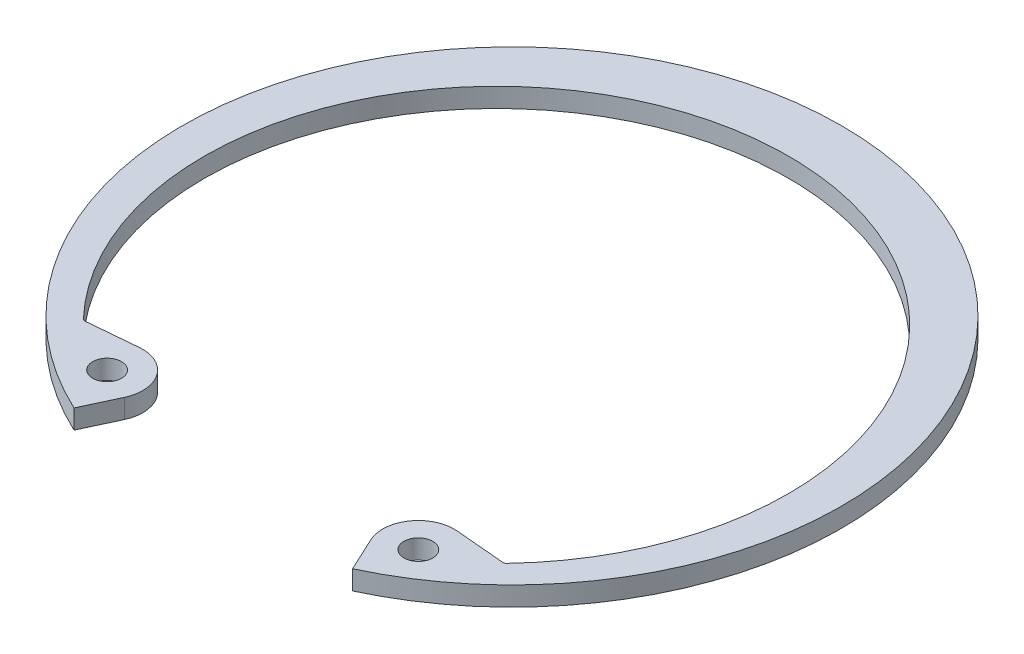
ISO-10303-21;
HEADER;
FILE_DESCRIPTION(('STEP AP214'),'2;1');
FILE_NAME('part.step','',(''),(''),'','','');
FILE_SCHEMA(('AUTOMOTIVE_DESIGN { 1 0 10303 214 1 1 1 1 }'));
ENDSEC;
DATA;
#1=APPLICATION_CONTEXT('core data for automotive mechanical design processes');
#2=APPLICATION_PROTOCOL_DEFINITION('international standard','automotive_design',2000,#1);
#3=PRODUCT_CONTEXT('',#1,'mechanical');
#4=PRODUCT('Part','Part','',(#3));
#5=PRODUCT_RELATED_PRODUCT_CATEGORY('part','',(#4));
#6=PRODUCT_DEFINITION_FORMATION('','',#4);
#7=PRODUCT_DEFINITION_CONTEXT('part definition',#1,'design');
#8=PRODUCT_DEFINITION('design','',#6,#7);
#9=PRODUCT_DEFINITION_SHAPE('','',#8);
#10=(LENGTH_UNIT() NAMED_UNIT(*) SI_UNIT(.MILLI.,.METRE.));
#11=(NAMED_UNIT(*) PLANE_ANGLE_UNIT() SI_UNIT($,.RADIAN.));
#12=(NAMED_UNIT(*) SI_UNIT($,.STERADIAN.) SOLID_ANGLE_UNIT());
#13=UNCERTAINTY_MEASURE_WITH_UNIT(LENGTH_MEASURE(1.E-05),#10,'distance_accuracy_value','');
#14=(GEOMETRIC_REPRESENTATION_CONTEXT(3) GLOBAL_UNCERTAINTY_ASSIGNED_CONTEXT((#13)) GLOBAL_UNIT_ASSIGNED_CONTEXT((#10,
#11,#12)) REPRESENTATION_CONTEXT('',''));
#15=CARTESIAN_POINT('',(0.,0.,0.));
#16=DIRECTION('',(0.,0.,1.));
#17=DIRECTION('',(1.,0.,0.));
#18=AXIS2_PLACEMENT_3D('',#15,#16,#17);
#19=CARTESIAN_POINT('',(12.7268526802508,-1.5748,20.3811488247153));
#20=DIRECTION('',(0.,1.,0.));
#21=DIRECTION('',(0.,0.,1.));
#22=AXIS2_PLACEMENT_3D('',#19,#20,#21);
#23=CYLINDRICAL_SURFACE('',#22,2.921);
#24=CARTESIAN_POINT('',(12.7268526802508,0.,20.3811488247153));
#25=DIRECTION('',(0.,1.,0.));
#26=DIRECTION('',(0.,0.,-1.));
#27=AXIS2_PLACEMENT_3D('',#24,#25,#26);
#28=CIRCLE('',#27,2.921);
#29=CARTESIAN_POINT('',(12.9814346048167,0.,17.4712641115893));
#30=VERTEX_POINT('',#29);
#31=CARTESIAN_POINT('',(10.0795276343167,0.,21.6156167672599));
#32=VERTEX_POINT('',#31);
#33=EDGE_CURVE('E156',#30,#32,#28,.T.);
#34=ORIENTED_EDGE('',*,*,#33,.F.);
#35=DIRECTION('',(0.,1.,0.));
#36=VECTOR('',#35,1.);
#37=CARTESIAN_POINT('',(12.9814346048167,-1.5748,17.4712641115893));
#38=LINE('',#37,#36);
#39=CARTESIAN_POINT('',(12.9814346048167,-1.5748,17.4712641115893));
#40=VERTEX_POINT('',#39);
#41=EDGE_CURVE('E133',#40,#30,#38,.T.);
#42=ORIENTED_EDGE('',*,*,#41,.F.);
#43=CARTESIAN_POINT('',(12.7268526802508,-1.5748,20.3811488247153));
#44=DIRECTION('',(0.,1.,0.));
#45=DIRECTION('',(0.,0.,-1.));
#46=AXIS2_PLACEMENT_3D('',#43,#44,#45);
#47=CIRCLE('',#46,2.921);
#48=CARTESIAN_POINT('',(10.0795276343167,-1.5748,21.6156167672599));
#49=VERTEX_POINT('',#48);
#50=EDGE_CURVE('E126',#40,#49,#47,.T.);
#51=ORIENTED_EDGE('',*,*,#50,.T.);
#52=DIRECTION('',(0.,1.,0.));
#53=VECTOR('',#52,1.);
#54=CARTESIAN_POINT('',(10.0795276343167,-1.5748,21.6156167672599));
#55=LINE('',#54,#53);
#56=EDGE_CURVE('E109',#49,#32,#55,.T.);
#57=ORIENTED_EDGE('',*,*,#56,.T.);
#58=EDGE_LOOP('',(#34,#42,#51,#57));
#59=FACE_BOUND('',#58,.T.);
#60=ADVANCED_FACE('F34',(#59),#23,.T.);
#61=CARTESIAN_POINT('',(17.2118873044227,-1.5748,17.8413807643875));
#62=DIRECTION('',(0.0871557427476606,0.,-0.996194698091745));
#63=DIRECTION('',(-0.996194698091745,0.,-0.0871557427476606));
#64=AXIS2_PLACEMENT_3D('',#61,#62,#63);
#65=PLANE('',#64);
#66=DIRECTION('',(-0.996194698091745,0.,-0.0871557427476606));
#67=VECTOR('',#66,1.);
#68=CARTESIAN_POINT('',(17.2118873044227,0.,17.8413807643875));
#69=LINE('',#68,#67);
#70=CARTESIAN_POINT('',(17.0905898602113,0.,17.8307686131043));
#71=VERTEX_POINT('',#70);
#72=EDGE_CURVE('E134',#71,#30,#69,.T.);
#73=ORIENTED_EDGE('',*,*,#72,.F.);
#74=DIRECTION('',(0.,-1.,0.));
#75=VECTOR('',#74,1.);
#76=CARTESIAN_POINT('',(17.0905898602113,-1.5748,17.8307686131043));
#77=LINE('',#76,#75);
#78=CARTESIAN_POINT('',(17.0905898602113,-1.5748,17.8307686131043));
#79=VERTEX_POINT('',#78);
#80=EDGE_CURVE('E49',#71,#79,#77,.T.);
#81=ORIENTED_EDGE('',*,*,#80,.T.);
#82=DIRECTION('',(-0.996194698091745,0.,-0.0871557427476606));
#83=VECTOR('',#82,1.);
#84=CARTESIAN_POINT('',(17.2118873044227,-1.5748,17.8413807643875));
#85=LINE('',#84,#83);
#86=EDGE_CURVE('E120',#79,#40,#85,.T.);
#87=ORIENTED_EDGE('',*,*,#86,.T.);
#88=ORIENTED_EDGE('',*,*,#41,.T.);
#89=EDGE_LOOP('',(#73,#81,#87,#88));
#90=FACE_BOUND('',#89,.T.);
#91=ADVANCED_FACE('F211',(#90),#65,.T.);
#92=CARTESIAN_POINT('',(0.,-1.5748,1.26484595654581));
#93=DIRECTION('',(0.,1.,0.));
#94=DIRECTION('',(0.,0.,1.));
#95=AXIS2_PLACEMENT_3D('',#92,#93,#94);
#96=CYLINDRICAL_SURFACE('',#95,23.8962459565458);
#97=CARTESIAN_POINT('',(0.,0.,1.26484595654581));
#98=DIRECTION('',(0.,-1.,0.));
#99=DIRECTION('',(0.,0.,1.));
#100=AXIS2_PLACEMENT_3D('',#97,#98,#99);
#101=CIRCLE('',#100,23.8962459565458);
#102=CARTESIAN_POINT('',(-17.296577666108,0.,17.7529923610396));
#103=VERTEX_POINT('',#102);
#104=CARTESIAN_POINT('',(17.2965776661081,0.,17.7529923610397));
#105=VERTEX_POINT('',#104);
#106=EDGE_CURVE('E136',#103,#105,#101,.T.);
#107=ORIENTED_EDGE('',*,*,#106,.F.);
#108=DIRECTION('',(0.,1.,0.));
#109=VECTOR('',#108,1.);
#110=CARTESIAN_POINT('',(-17.2965776661081,-1.5748,17.7529923610396));
#111=LINE('',#110,#109);
#112=CARTESIAN_POINT('',(-17.296577666108,-1.5748,17.7529923610396));
#113=VERTEX_POINT('',#112);
#114=EDGE_CURVE('E187',#103,#113,#111,.F.);
#115=ORIENTED_EDGE('',*,*,#114,.T.);
#116=CARTESIAN_POINT('',(0.,-1.5748,1.26484595654581));
#117=DIRECTION('',(0.,-1.,0.));
#118=DIRECTION('',(0.,0.,1.));
#119=AXIS2_PLACEMENT_3D('',#116,#117,#118);
#120=CIRCLE('',#119,23.8962459565458);
#121=CARTESIAN_POINT('',(17.2965776661081,-1.5748,17.7529923610397));
#122=VERTEX_POINT('',#121);
#123=EDGE_CURVE('E152',#113,#122,#120,.T.);
#124=ORIENTED_EDGE('',*,*,#123,.T.);
#125=DIRECTION('',(0.,1.,0.));
#126=VECTOR('',#125,1.);
#127=CARTESIAN_POINT('',(17.2965776661081,-1.5748,17.7529923610397));
#128=LINE('',#127,#126);
#129=EDGE_CURVE('E184',#122,#105,#128,.T.);
#130=ORIENTED_EDGE('',*,*,#129,.T.);
#131=EDGE_LOOP('',(#107,#115,#124,#130));
#132=FACE_BOUND('',#131,.T.);
#133=ADVANCED_FACE('F207',(#132),#96,.F.);
#134=CARTESIAN_POINT('',(-17.2118873044226,-1.5748,17.8413807643875));
#135=DIRECTION('',(-0.0871557427476557,0.,-0.996194698091746));
#136=DIRECTION('',(-0.996194698091746,0.,0.0871557427476557));
#137=AXIS2_PLACEMENT_3D('',#134,#135,#136);
#138=PLANE('',#137);
#139=DIRECTION('',(-0.996194698091746,0.,0.0871557427476557));
#140=VECTOR('',#139,1.);
#141=CARTESIAN_POINT('',(-17.2118873044226,-1.5748,17.8413807643875));
#142=LINE('',#141,#140);
#143=CARTESIAN_POINT('',(-12.9814346048167,-1.5748,17.4712641115893));
#144=VERTEX_POINT('',#143);
#145=CARTESIAN_POINT('',(-17.0905898602113,-1.5748,17.8307686131043));
#146=VERTEX_POINT('',#145);
#147=EDGE_CURVE('E149',#144,#146,#142,.T.);
#148=ORIENTED_EDGE('',*,*,#147,.T.);
#149=DIRECTION('',(0.,-1.,0.));
#150=VECTOR('',#149,1.);
#151=CARTESIAN_POINT('',(-17.0905898602113,0.,17.8307686131043));
#152=LINE('',#151,#150);
#153=CARTESIAN_POINT('',(-17.0905898602113,0.,17.8307686131043));
#154=VERTEX_POINT('',#153);
#155=EDGE_CURVE('E174',#146,#154,#152,.F.);
#156=ORIENTED_EDGE('',*,*,#155,.T.);
#157=DIRECTION('',(-0.996194698091746,0.,0.0871557427476557));
#158=VECTOR('',#157,1.);
#159=CARTESIAN_POINT('',(-17.2118873044226,0.,17.8413807643875));
#160=LINE('',#159,#158);
#161=CARTESIAN_POINT('',(-12.9814346048167,0.,17.4712641115893));
#162=VERTEX_POINT('',#161);
#163=EDGE_CURVE('E169',#162,#154,#160,.T.);
#164=ORIENTED_EDGE('',*,*,#163,.F.);
#165=DIRECTION('',(0.,1.,0.));
#166=VECTOR('',#165,1.);
#167=CARTESIAN_POINT('',(-12.9814346048167,-1.5748,17.4712641115893));
#168=LINE('',#167,#166);
#169=EDGE_CURVE('E175',#144,#162,#168,.T.);
#170=ORIENTED_EDGE('',*,*,#169,.F.);
#171=EDGE_LOOP('',(#148,#156,#164,#170));
#172=FACE_BOUND('',#171,.T.);
#173=ADVANCED_FACE('F201',(#172),#138,.T.);
#174=CARTESIAN_POINT('',(-12.7268526802508,-1.5748,20.3811488247153));
#175=DIRECTION('',(0.,1.,0.));
#176=DIRECTION('',(0.,0.,1.));
#177=AXIS2_PLACEMENT_3D('',#174,#175,#176);
#178=CYLINDRICAL_SURFACE('',#177,2.921);
#179=CARTESIAN_POINT('',(-12.7268526802508,0.,20.3811488247153));
#180=DIRECTION('',(0.,1.,0.));
#181=DIRECTION('',(0.,0.,1.));
#182=AXIS2_PLACEMENT_3D('',#179,#180,#181);
#183=CIRCLE('',#182,2.921);
#184=CARTESIAN_POINT('',(-10.0795276343167,0.,21.6156167672599));
#185=VERTEX_POINT('',#184);
#186=EDGE_CURVE('E166',#185,#162,#183,.T.);
#187=ORIENTED_EDGE('',*,*,#186,.F.);
#188=DIRECTION('',(0.,1.,0.));
#189=VECTOR('',#188,1.);
#190=CARTESIAN_POINT('',(-10.0795276343167,-1.5748,21.6156167672599));
#191=LINE('',#190,#189);
#192=CARTESIAN_POINT('',(-10.0795276343167,-1.5748,21.6156167672599));
#193=VERTEX_POINT('',#192);
#194=EDGE_CURVE('E177',#193,#185,#191,.T.);
#195=ORIENTED_EDGE('',*,*,#194,.F.);
#196=CARTESIAN_POINT('',(-12.7268526802508,-1.5748,20.3811488247153));
#197=DIRECTION('',(0.,1.,0.));
#198=DIRECTION('',(0.,0.,1.));
#199=AXIS2_PLACEMENT_3D('',#196,#197,#198);
#200=CIRCLE('',#199,2.921);
#201=EDGE_CURVE('E146',#193,#144,#200,.T.);
#202=ORIENTED_EDGE('',*,*,#201,.T.);
#203=ORIENTED_EDGE('',*,*,#169,.T.);
#204=EDGE_LOOP('',(#187,#195,#202,#203));
#205=FACE_BOUND('',#204,.T.);
#206=ADVANCED_FACE('F220',(#205),#178,.T.);
#207=CARTESIAN_POINT('',(-11.3893085829547,-1.5748,24.4244510759656));
#208=DIRECTION('',(0.906307787036652,0.,0.422618261740694));
#209=DIRECTION('',(0.422618261740694,0.,-0.906307787036653));
#210=AXIS2_PLACEMENT_3D('',#207,#208,#209);
#211=PLANE('',#210);
#212=DIRECTION('',(0.422618261740694,0.,-0.906307787036652));
#213=VECTOR('',#212,1.);
#214=CARTESIAN_POINT('',(-11.3893085829547,0.,24.4244510759656));
#215=LINE('',#214,#213);
#216=CARTESIAN_POINT('',(-11.3893085829547,0.,24.4244510759656));
#217=VERTEX_POINT('',#216);
#218=EDGE_CURVE('E163',#217,#185,#215,.T.);
#219=ORIENTED_EDGE('',*,*,#218,.F.);
#220=DIRECTION('',(0.,1.,0.));
#221=VECTOR('',#220,1.);
#222=CARTESIAN_POINT('',(-11.3893085829547,-1.5748,24.4244510759656));
#223=LINE('',#222,#221);
#224=CARTESIAN_POINT('',(-11.3893085829547,-1.5748,24.4244510759656));
#225=VERTEX_POINT('',#224);
#226=EDGE_CURVE('E179',#225,#217,#223,.T.);
#227=ORIENTED_EDGE('',*,*,#226,.F.);
#228=DIRECTION('',(0.422618261740694,0.,-0.906307787036652));
#229=VECTOR('',#228,1.);
#230=CARTESIAN_POINT('',(-11.3893085829547,-1.5748,24.4244510759656));
#231=LINE('',#230,#229);
#232=EDGE_CURVE('E143',#225,#193,#231,.T.);
#233=ORIENTED_EDGE('',*,*,#232,.T.);
#234=ORIENTED_EDGE('',*,*,#194,.T.);
#235=EDGE_LOOP('',(#219,#227,#233,#234));
#236=FACE_BOUND('',#235,.T.);
#237=ADVANCED_FACE('F217',(#236),#211,.T.);
#238=CARTESIAN_POINT('',(0.,-1.5748,0.));
#239=DIRECTION('',(0.,1.,0.));
#240=DIRECTION('',(0.,0.,1.));
#241=AXIS2_PLACEMENT_3D('',#238,#239,#240);
#242=CYLINDRICAL_SURFACE('',#241,26.9494);
#243=CARTESIAN_POINT('',(0.,0.,0.));
#244=DIRECTION('',(0.,1.,0.));
#245=DIRECTION('',(0.,0.,1.));
#246=AXIS2_PLACEMENT_3D('',#243,#244,#245);
#247=CIRCLE('',#246,26.9494);
#248=CARTESIAN_POINT('',(11.3893085829547,0.,24.4244510759656));
#249=VERTEX_POINT('',#248);
#250=EDGE_CURVE('E160',#249,#217,#247,.T.);
#251=ORIENTED_EDGE('',*,*,#250,.F.);
#252=DIRECTION('',(0.,1.,0.));
#253=VECTOR('',#252,1.);
#254=CARTESIAN_POINT('',(11.3893085829547,-1.5748,24.4244510759656));
#255=LINE('',#254,#253);
#256=CARTESIAN_POINT('',(11.3893085829547,-1.5748,24.4244510759656));
#257=VERTEX_POINT('',#256);
#258=EDGE_CURVE('E119',#257,#249,#255,.T.);
#259=ORIENTED_EDGE('',*,*,#258,.F.);
#260=CARTESIAN_POINT('',(0.,-1.5748,0.));
#261=DIRECTION('',(0.,1.,0.));
#262=DIRECTION('',(0.,0.,1.));
#263=AXIS2_PLACEMENT_3D('',#260,#261,#262);
#264=CIRCLE('',#263,26.9494);
#265=EDGE_CURVE('E129',#257,#225,#264,.T.);
#266=ORIENTED_EDGE('',*,*,#265,.T.);
#267=ORIENTED_EDGE('',*,*,#226,.T.);
#268=EDGE_LOOP('',(#251,#259,#266,#267));
#269=FACE_BOUND('',#268,.T.);
#270=ADVANCED_FACE('F215',(#269),#242,.T.);
#271=CARTESIAN_POINT('',(11.3893085829547,-1.5748,24.4244510759656));
#272=DIRECTION('',(-0.906307787036652,0.,0.422618261740694));
#273=DIRECTION('',(0.422618261740694,0.,0.906307787036653));
#274=AXIS2_PLACEMENT_3D('',#271,#272,#273);
#275=PLANE('',#274);
#276=DIRECTION('',(0.422618261740694,0.,0.906307787036652));
#277=VECTOR('',#276,1.);
#278=CARTESIAN_POINT('',(11.3893085829547,0.,24.4244510759656));
#279=LINE('',#278,#277);
#280=EDGE_CURVE('E114',#32,#249,#279,.T.);
#281=ORIENTED_EDGE('',*,*,#280,.F.);
#282=ORIENTED_EDGE('',*,*,#56,.F.);
#283=DIRECTION('',(0.422618261740694,0.,0.906307787036652));
#284=VECTOR('',#283,1.);
#285=CARTESIAN_POINT('',(11.3893085829547,-1.5748,24.4244510759656));
#286=LINE('',#285,#284);
#287=EDGE_CURVE('E112',#49,#257,#286,.T.);
#288=ORIENTED_EDGE('',*,*,#287,.T.);
#289=ORIENTED_EDGE('',*,*,#258,.T.);
#290=EDGE_LOOP('',(#281,#282,#288,#289));
#291=FACE_BOUND('',#290,.T.);
#292=ADVANCED_FACE('F111',(#291),#275,.T.);
#293=CARTESIAN_POINT('',(12.7268526802508,-1.5748,20.3811488247153));
#294=DIRECTION('',(0.,-1.,0.));
#295=DIRECTION('',(0.,0.,-1.));
#296=AXIS2_PLACEMENT_3D('',#293,#294,#295);
#297=PLANE('',#296);
#298=CARTESIAN_POINT('',(-12.7268526802508,-1.5748,20.3811488247153));
#299=DIRECTION('',(0.,1.,0.));
#300=DIRECTION('',(0.,0.,1.));
#301=AXIS2_PLACEMENT_3D('',#298,#299,#300);
#302=CIRCLE('',#301,1.1811);
#303=CARTESIAN_POINT('',(-12.7268526802508,-1.5748,21.5622488247153));
#304=VERTEX_POINT('',#303);
#305=EDGE_CURVE('E361',#304,#304,#302,.T.);
#306=ORIENTED_EDGE('',*,*,#305,.T.);
#307=EDGE_LOOP('',(#306));
#308=FACE_BOUND('',#307,.T.);
#309=CARTESIAN_POINT('',(12.7268526802508,-1.5748,20.3811488247153));
#310=DIRECTION('',(0.,1.,0.));
#311=DIRECTION('',(0.,0.,1.));
#312=AXIS2_PLACEMENT_3D('',#309,#310,#311);
#313=CIRCLE('',#312,1.1811);
#314=CARTESIAN_POINT('',(12.7268526802508,-1.5748,21.5622488247153));
#315=VERTEX_POINT('',#314);
#316=EDGE_CURVE('E158',#315,#315,#313,.T.);
#317=ORIENTED_EDGE('',*,*,#316,.T.);
#318=EDGE_LOOP('',(#317));
#319=FACE_BOUND('',#318,.T.);
#320=ORIENTED_EDGE('',*,*,#50,.F.);
#321=ORIENTED_EDGE('',*,*,#86,.F.);
#322=CARTESIAN_POINT('',(17.1127274188692,-1.5748,17.577735159789));
#323=DIRECTION('',(0.,-1.,0.));
#324=DIRECTION('',(0.,0.,-1.));
#325=AXIS2_PLACEMENT_3D('',#322,#323,#324);
#326=CIRCLE('',#325,0.254);
#327=EDGE_CURVE('E11',#79,#122,#326,.F.);
#328=ORIENTED_EDGE('',*,*,#327,.T.);
#329=ORIENTED_EDGE('',*,*,#123,.F.);
#330=CARTESIAN_POINT('',(-17.1127274188692,-1.5748,17.577735159789));
#331=DIRECTION('',(0.,-1.,0.));
#332=DIRECTION('',(0.,0.,-1.));
#333=AXIS2_PLACEMENT_3D('',#330,#331,#332);
#334=CIRCLE('',#333,0.254);
#335=EDGE_CURVE('E192',#113,#146,#334,.F.);
#336=ORIENTED_EDGE('',*,*,#335,.T.);
#337=ORIENTED_EDGE('',*,*,#147,.F.);
#338=ORIENTED_EDGE('',*,*,#201,.F.);
#339=ORIENTED_EDGE('',*,*,#232,.F.);
#340=ORIENTED_EDGE('',*,*,#265,.F.);
#341=ORIENTED_EDGE('',*,*,#287,.F.);
#342=EDGE_LOOP('',(#320,#321,#328,#329,#336,#337,#338,#339,#340,#341));
#343=FACE_BOUND('',#342,.T.);
#344=ADVANCED_FACE('F125',(#308,#319,#343),#297,.T.);
#345=CARTESIAN_POINT('',(12.7268526802508,0.,20.3811488247153));
#346=DIRECTION('',(0.,-1.,0.));
#347=DIRECTION('',(0.,0.,-1.));
#348=AXIS2_PLACEMENT_3D('',#345,#346,#347);
#349=PLANE('',#348);
#350=CARTESIAN_POINT('',(-12.7268526802508,0.,20.3811488247153));
#351=DIRECTION('',(0.,1.,0.));
#352=DIRECTION('',(0.,0.,1.));
#353=AXIS2_PLACEMENT_3D('',#350,#351,#352);
#354=CIRCLE('',#353,1.1811);
#355=CARTESIAN_POINT('',(-12.7268526802508,0.,21.5622488247153));
#356=VERTEX_POINT('',#355);
#357=EDGE_CURVE('E357',#356,#356,#354,.T.);
#358=ORIENTED_EDGE('',*,*,#357,.F.);
#359=EDGE_LOOP('',(#358));
#360=FACE_BOUND('',#359,.T.);
#361=CARTESIAN_POINT('',(12.7268526802508,0.,20.3811488247153));
#362=DIRECTION('',(0.,1.,0.));
#363=DIRECTION('',(0.,0.,1.));
#364=AXIS2_PLACEMENT_3D('',#361,#362,#363);
#365=CIRCLE('',#364,1.1811);
#366=CARTESIAN_POINT('',(12.7268526802508,0.,21.5622488247153));
#367=VERTEX_POINT('',#366);
#368=EDGE_CURVE('E139',#367,#367,#365,.T.);
#369=ORIENTED_EDGE('',*,*,#368,.F.);
#370=EDGE_LOOP('',(#369));
#371=FACE_BOUND('',#370,.T.);
#372=ORIENTED_EDGE('',*,*,#33,.T.);
#373=ORIENTED_EDGE('',*,*,#280,.T.);
#374=ORIENTED_EDGE('',*,*,#250,.T.);
#375=ORIENTED_EDGE('',*,*,#218,.T.);
#376=ORIENTED_EDGE('',*,*,#186,.T.);
#377=ORIENTED_EDGE('',*,*,#163,.T.);
#378=CARTESIAN_POINT('',(-17.1127274188692,0.,17.577735159789));
#379=DIRECTION('',(0.,-1.,0.));
#380=DIRECTION('',(0.,0.,-1.));
#381=AXIS2_PLACEMENT_3D('',#378,#379,#380);
#382=CIRCLE('',#381,0.254);
#383=EDGE_CURVE('E190',#154,#103,#382,.T.);
#384=ORIENTED_EDGE('',*,*,#383,.T.);
#385=ORIENTED_EDGE('',*,*,#106,.T.);
#386=CARTESIAN_POINT('',(17.1127274188692,0.,17.577735159789));
#387=DIRECTION('',(0.,-1.,0.));
#388=DIRECTION('',(0.,0.,-1.));
#389=AXIS2_PLACEMENT_3D('',#386,#387,#388);
#390=CIRCLE('',#389,0.254);
#391=EDGE_CURVE('E42',#105,#71,#390,.T.);
#392=ORIENTED_EDGE('',*,*,#391,.T.);
#393=ORIENTED_EDGE('',*,*,#72,.T.);
#394=EDGE_LOOP('',(#372,#373,#374,#375,#376,#377,#384,#385,#392,#393));
#395=FACE_BOUND('',#394,.T.);
#396=ADVANCED_FACE('F205',(#360,#371,#395),#349,.F.);
#397=CARTESIAN_POINT('',(12.7268526802508,-1.5748,20.3811488247153));
#398=DIRECTION('',(0.,1.,0.));
#399=DIRECTION('',(0.,0.,1.));
#400=AXIS2_PLACEMENT_3D('',#397,#398,#399);
#401=CYLINDRICAL_SURFACE('',#400,1.1811);
#402=ORIENTED_EDGE('',*,*,#316,.F.);
#403=EDGE_LOOP('',(#402));
#404=FACE_BOUND('',#403,.T.);
#405=ORIENTED_EDGE('',*,*,#368,.T.);
#406=EDGE_LOOP('',(#405));
#407=FACE_BOUND('',#406,.T.);
#408=ADVANCED_FACE('F243',(#404,#407),#401,.F.);
#409=CARTESIAN_POINT('',(-12.7268526802508,-1.5748,20.3811488247153));
#410=DIRECTION('',(0.,1.,0.));
#411=DIRECTION('',(0.,0.,1.));
#412=AXIS2_PLACEMENT_3D('',#409,#410,#411);
#413=CYLINDRICAL_SURFACE('',#412,1.1811);
#414=ORIENTED_EDGE('',*,*,#305,.F.);
#415=EDGE_LOOP('',(#414));
#416=FACE_BOUND('',#415,.T.);
#417=ORIENTED_EDGE('',*,*,#357,.T.);
#418=EDGE_LOOP('',(#417));
#419=FACE_BOUND('',#418,.T.);
#420=ADVANCED_FACE('F238',(#416,#419),#413,.F.);
#421=CARTESIAN_POINT('',(-17.1127274188692,-1.5748,17.577735159789));
#422=DIRECTION('',(0.,1.,0.));
#423=DIRECTION('',(0.,0.,1.));
#424=AXIS2_PLACEMENT_3D('',#421,#422,#423);
#425=CYLINDRICAL_SURFACE('',#424,0.254);
#426=ORIENTED_EDGE('',*,*,#335,.F.);
#427=ORIENTED_EDGE('',*,*,#114,.F.);
#428=ORIENTED_EDGE('',*,*,#383,.F.);
#429=ORIENTED_EDGE('',*,*,#155,.F.);
#430=EDGE_LOOP('',(#426,#427,#428,#429));
#431=FACE_BOUND('',#430,.T.);
#432=ADVANCED_FACE('F203',(#431),#425,.F.);
#433=CARTESIAN_POINT('',(17.1127274188692,-1.5748,17.577735159789));
#434=DIRECTION('',(0.,1.,0.));
#435=DIRECTION('',(0.,0.,1.));
#436=AXIS2_PLACEMENT_3D('',#433,#434,#435);
#437=CYLINDRICAL_SURFACE('',#436,0.254);
#438=ORIENTED_EDGE('',*,*,#327,.F.);
#439=ORIENTED_EDGE('',*,*,#80,.F.);
#440=ORIENTED_EDGE('',*,*,#391,.F.);
#441=ORIENTED_EDGE('',*,*,#129,.F.);
#442=EDGE_LOOP('',(#438,#439,#440,#441));
#443=FACE_BOUND('',#442,.T.);
#444=ADVANCED_FACE('F36',(#443),#437,.F.);
#445=CLOSED_SHELL('',(#60,#91,#133,#173,#206,#237,#270,#292,#344,#396,#408,#420,#432,#444));
#446=MANIFOLD_SOLID_BREP('B2',#445);
#447=ADVANCED_BREP_SHAPE_REPRESENTATION('',(#18,#446),#14);
#448=SHAPE_DEFINITION_REPRESENTATION(#9,#447);
ENDSEC;
END-ISO-10303-21;
